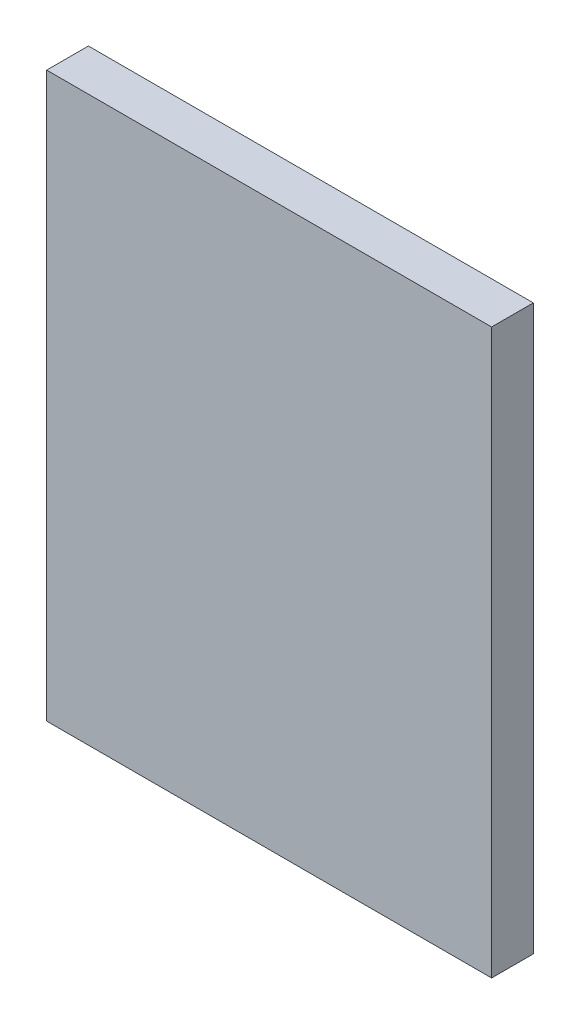
ISO-10303-21;
HEADER;
FILE_DESCRIPTION(('STEP AP214'),'2;1');
FILE_NAME('part.step','',(''),(''),'','','');
FILE_SCHEMA(('AUTOMOTIVE_DESIGN { 1 0 10303 214 1 1 1 1 }'));
ENDSEC;
DATA;
#1=APPLICATION_CONTEXT('core data for automotive mechanical design processes');
#2=APPLICATION_PROTOCOL_DEFINITION('international standard','automotive_design',2000,#1);
#3=PRODUCT_CONTEXT('',#1,'mechanical');
#4=PRODUCT('Part','Part','',(#3));
#5=PRODUCT_RELATED_PRODUCT_CATEGORY('part','',(#4));
#6=PRODUCT_DEFINITION_FORMATION('','',#4);
#7=PRODUCT_DEFINITION_CONTEXT('part definition',#1,'design');
#8=PRODUCT_DEFINITION('design','',#6,#7);
#9=PRODUCT_DEFINITION_SHAPE('','',#8);
#10=(LENGTH_UNIT() NAMED_UNIT(*) SI_UNIT(.MILLI.,.METRE.));
#11=(NAMED_UNIT(*) PLANE_ANGLE_UNIT() SI_UNIT($,.RADIAN.));
#12=(NAMED_UNIT(*) SI_UNIT($,.STERADIAN.) SOLID_ANGLE_UNIT());
#13=UNCERTAINTY_MEASURE_WITH_UNIT(LENGTH_MEASURE(1.E-05),#10,'distance_accuracy_value','');
#14=(GEOMETRIC_REPRESENTATION_CONTEXT(3) GLOBAL_UNCERTAINTY_ASSIGNED_CONTEXT((#13)) GLOBAL_UNIT_ASSIGNED_CONTEXT((#10,
#11,#12)) REPRESENTATION_CONTEXT('',''));
#15=CARTESIAN_POINT('',(0.,0.,0.));
#16=DIRECTION('',(0.,0.,1.));
#17=DIRECTION('',(1.,0.,0.));
#18=AXIS2_PLACEMENT_3D('',#15,#16,#17);
#19=CARTESIAN_POINT('',(0.,0.,3.));
#20=DIRECTION('',(1.,0.,0.));
#21=DIRECTION('',(0.,0.,-1.));
#22=AXIS2_PLACEMENT_3D('',#19,#20,#21);
#23=PLANE('',#22);
#24=DIRECTION('',(0.,-1.,0.));
#25=VECTOR('',#24,1.);
#26=CARTESIAN_POINT('',(0.,0.,0.));
#27=LINE('',#26,#25);
#28=CARTESIAN_POINT('',(0.,40.55,0.));
#29=VERTEX_POINT('',#28);
#30=CARTESIAN_POINT('',(0.,0.,0.));
#31=VERTEX_POINT('',#30);
#32=EDGE_CURVE('E96',#29,#31,#27,.T.);
#33=ORIENTED_EDGE('',*,*,#32,.T.);
#34=DIRECTION('',(0.,0.,-1.));
#35=VECTOR('',#34,1.);
#36=CARTESIAN_POINT('',(0.,0.,3.));
#37=LINE('',#36,#35);
#38=CARTESIAN_POINT('',(0.,0.,3.));
#39=VERTEX_POINT('',#38);
#40=EDGE_CURVE('E11',#39,#31,#37,.T.);
#41=ORIENTED_EDGE('',*,*,#40,.F.);
#42=DIRECTION('',(0.,-1.,0.));
#43=VECTOR('',#42,1.);
#44=CARTESIAN_POINT('',(0.,0.,3.));
#45=LINE('',#44,#43);
#46=CARTESIAN_POINT('',(0.,40.55,3.));
#47=VERTEX_POINT('',#46);
#48=EDGE_CURVE('E84',#47,#39,#45,.T.);
#49=ORIENTED_EDGE('',*,*,#48,.F.);
#50=DIRECTION('',(0.,0.,-1.));
#51=VECTOR('',#50,1.);
#52=CARTESIAN_POINT('',(0.,40.55,3.));
#53=LINE('',#52,#51);
#54=EDGE_CURVE('E92',#47,#29,#53,.T.);
#55=ORIENTED_EDGE('',*,*,#54,.T.);
#56=EDGE_LOOP('',(#33,#41,#49,#55));
#57=FACE_BOUND('',#56,.T.);
#58=ADVANCED_FACE('F33',(#57),#23,.F.);
#59=CARTESIAN_POINT('',(0.,0.,3.));
#60=DIRECTION('',(0.,1.,0.));
#61=DIRECTION('',(0.,0.,1.));
#62=AXIS2_PLACEMENT_3D('',#59,#60,#61);
#63=PLANE('',#62);
#64=DIRECTION('',(1.,0.,0.));
#65=VECTOR('',#64,1.);
#66=CARTESIAN_POINT('',(0.,0.,0.));
#67=LINE('',#66,#65);
#68=CARTESIAN_POINT('',(32.,0.,0.));
#69=VERTEX_POINT('',#68);
#70=EDGE_CURVE('E88',#31,#69,#67,.T.);
#71=ORIENTED_EDGE('',*,*,#70,.T.);
#72=DIRECTION('',(0.,0.,-1.));
#73=VECTOR('',#72,1.);
#74=CARTESIAN_POINT('',(32.,0.,3.));
#75=LINE('',#74,#73);
#76=CARTESIAN_POINT('',(32.,0.,3.));
#77=VERTEX_POINT('',#76);
#78=EDGE_CURVE('E41',#77,#69,#75,.T.);
#79=ORIENTED_EDGE('',*,*,#78,.F.);
#80=DIRECTION('',(1.,0.,0.));
#81=VECTOR('',#80,1.);
#82=CARTESIAN_POINT('',(0.,0.,3.));
#83=LINE('',#82,#81);
#84=EDGE_CURVE('E79',#39,#77,#83,.T.);
#85=ORIENTED_EDGE('',*,*,#84,.F.);
#86=ORIENTED_EDGE('',*,*,#40,.T.);
#87=EDGE_LOOP('',(#71,#79,#85,#86));
#88=FACE_BOUND('',#87,.T.);
#89=ADVANCED_FACE('F87',(#88),#63,.F.);
#90=CARTESIAN_POINT('',(32.,0.,3.));
#91=DIRECTION('',(-1.,0.,0.));
#92=DIRECTION('',(0.,-1.,0.));
#93=AXIS2_PLACEMENT_3D('',#90,#91,#92);
#94=PLANE('',#93);
#95=DIRECTION('',(0.,1.,0.));
#96=VECTOR('',#95,1.);
#97=CARTESIAN_POINT('',(32.,0.,0.));
#98=LINE('',#97,#96);
#99=CARTESIAN_POINT('',(32.,40.55,0.));
#100=VERTEX_POINT('',#99);
#101=EDGE_CURVE('E66',#69,#100,#98,.T.);
#102=ORIENTED_EDGE('',*,*,#101,.T.);
#103=DIRECTION('',(0.,0.,-1.));
#104=VECTOR('',#103,1.);
#105=CARTESIAN_POINT('',(32.,40.55,3.));
#106=LINE('',#105,#104);
#107=CARTESIAN_POINT('',(32.,40.55,3.));
#108=VERTEX_POINT('',#107);
#109=EDGE_CURVE('E89',#108,#100,#106,.T.);
#110=ORIENTED_EDGE('',*,*,#109,.F.);
#111=DIRECTION('',(0.,1.,0.));
#112=VECTOR('',#111,1.);
#113=CARTESIAN_POINT('',(32.,0.,3.));
#114=LINE('',#113,#112);
#115=EDGE_CURVE('E82',#77,#108,#114,.T.);
#116=ORIENTED_EDGE('',*,*,#115,.F.);
#117=ORIENTED_EDGE('',*,*,#78,.T.);
#118=EDGE_LOOP('',(#102,#110,#116,#117));
#119=FACE_BOUND('',#118,.T.);
#120=ADVANCED_FACE('F90',(#119),#94,.F.);
#121=CARTESIAN_POINT('',(0.,40.55,3.));
#122=DIRECTION('',(0.,-1.,0.));
#123=DIRECTION('',(0.,0.,-1.));
#124=AXIS2_PLACEMENT_3D('',#121,#122,#123);
#125=PLANE('',#124);
#126=DIRECTION('',(-1.,0.,0.));
#127=VECTOR('',#126,1.);
#128=CARTESIAN_POINT('',(0.,40.55,0.));
#129=LINE('',#128,#127);
#130=EDGE_CURVE('E72',#100,#29,#129,.T.);
#131=ORIENTED_EDGE('',*,*,#130,.T.);
#132=ORIENTED_EDGE('',*,*,#54,.F.);
#133=DIRECTION('',(-1.,0.,0.));
#134=VECTOR('',#133,1.);
#135=CARTESIAN_POINT('',(0.,40.55,3.));
#136=LINE('',#135,#134);
#137=EDGE_CURVE('E49',#108,#47,#136,.T.);
#138=ORIENTED_EDGE('',*,*,#137,.F.);
#139=ORIENTED_EDGE('',*,*,#109,.T.);
#140=EDGE_LOOP('',(#131,#132,#138,#139));
#141=FACE_BOUND('',#140,.T.);
#142=ADVANCED_FACE('F103',(#141),#125,.F.);
#143=CARTESIAN_POINT('',(0.,0.,3.));
#144=DIRECTION('',(0.,0.,-1.));
#145=DIRECTION('',(-1.,0.,0.));
#146=AXIS2_PLACEMENT_3D('',#143,#144,#145);
#147=PLANE('',#146);
#148=ORIENTED_EDGE('',*,*,#48,.T.);
#149=ORIENTED_EDGE('',*,*,#84,.T.);
#150=ORIENTED_EDGE('',*,*,#115,.T.);
#151=ORIENTED_EDGE('',*,*,#137,.T.);
#152=EDGE_LOOP('',(#148,#149,#150,#151));
#153=FACE_BOUND('',#152,.T.);
#154=ADVANCED_FACE('F80',(#153),#147,.F.);
#155=CARTESIAN_POINT('',(0.,0.,0.));
#156=DIRECTION('',(0.,0.,-1.));
#157=DIRECTION('',(-1.,0.,0.));
#158=AXIS2_PLACEMENT_3D('',#155,#156,#157);
#159=PLANE('',#158);
#160=ORIENTED_EDGE('',*,*,#32,.F.);
#161=ORIENTED_EDGE('',*,*,#130,.F.);
#162=ORIENTED_EDGE('',*,*,#101,.F.);
#163=ORIENTED_EDGE('',*,*,#70,.F.);
#164=EDGE_LOOP('',(#160,#161,#162,#163));
#165=FACE_BOUND('',#164,.T.);
#166=ADVANCED_FACE('F106',(#165),#159,.T.);
#167=CLOSED_SHELL('',(#58,#89,#120,#142,#154,#166));
#168=MANIFOLD_SOLID_BREP('B2',#167);
#169=ADVANCED_BREP_SHAPE_REPRESENTATION('',(#18,#168),#14);
#170=SHAPE_DEFINITION_REPRESENTATION(#9,#169);
ENDSEC;
END-ISO-10303-21;
